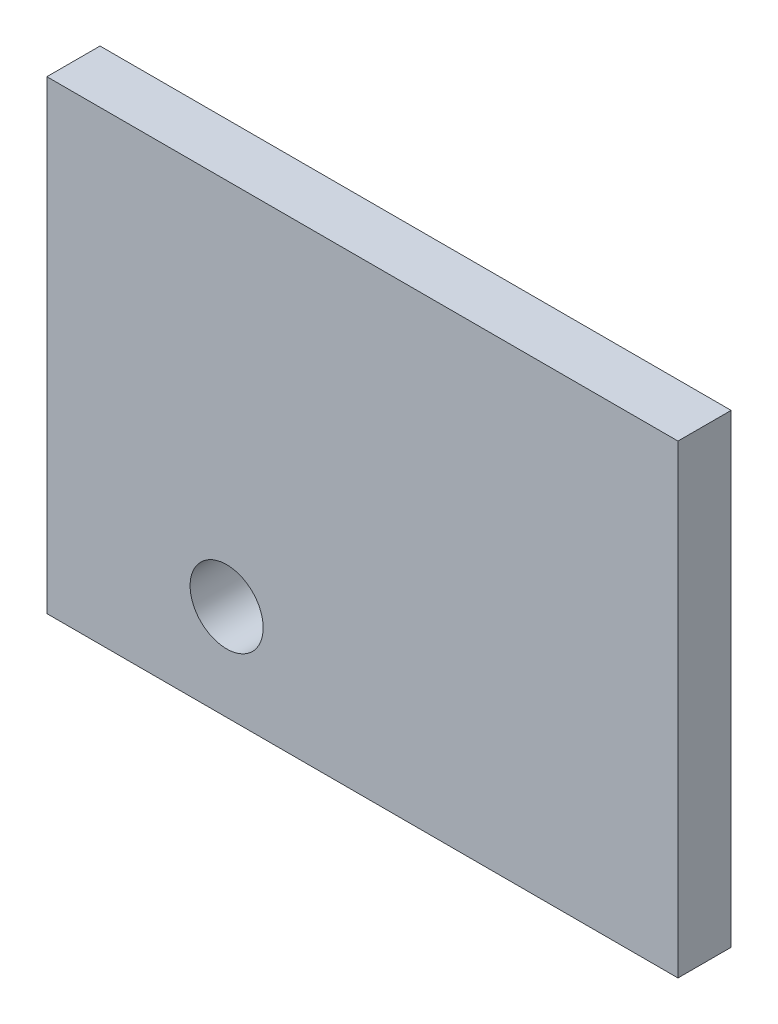
ISO-10303-21;
HEADER;
FILE_DESCRIPTION(('STEP AP214'),'2;1');
FILE_NAME('part.step','',(''),(''),'','','');
FILE_SCHEMA(('AUTOMOTIVE_DESIGN { 1 0 10303 214 1 1 1 1 }'));
ENDSEC;
DATA;
#1=APPLICATION_CONTEXT('core data for automotive mechanical design processes');
#2=APPLICATION_PROTOCOL_DEFINITION('international standard','automotive_design',2000,#1);
#3=PRODUCT_CONTEXT('',#1,'mechanical');
#4=PRODUCT('Part','Part','',(#3));
#5=PRODUCT_RELATED_PRODUCT_CATEGORY('part','',(#4));
#6=PRODUCT_DEFINITION_FORMATION('','',#4);
#7=PRODUCT_DEFINITION_CONTEXT('part definition',#1,'design');
#8=PRODUCT_DEFINITION('design','',#6,#7);
#9=PRODUCT_DEFINITION_SHAPE('','',#8);
#10=(LENGTH_UNIT() NAMED_UNIT(*) SI_UNIT(.MILLI.,.METRE.));
#11=(NAMED_UNIT(*) PLANE_ANGLE_UNIT() SI_UNIT($,.RADIAN.));
#12=(NAMED_UNIT(*) SI_UNIT($,.STERADIAN.) SOLID_ANGLE_UNIT());
#13=UNCERTAINTY_MEASURE_WITH_UNIT(LENGTH_MEASURE(1.E-05),#10,'distance_accuracy_value','');
#14=(GEOMETRIC_REPRESENTATION_CONTEXT(3) GLOBAL_UNCERTAINTY_ASSIGNED_CONTEXT((#13)) GLOBAL_UNIT_ASSIGNED_CONTEXT((#10,
#11,#12)) REPRESENTATION_CONTEXT('',''));
#15=CARTESIAN_POINT('',(0.,0.,0.));
#16=DIRECTION('',(0.,0.,1.));
#17=DIRECTION('',(1.,0.,0.));
#18=AXIS2_PLACEMENT_3D('',#15,#16,#17);
#19=CARTESIAN_POINT('',(-11.,-7.,1.6));
#20=DIRECTION('',(0.,0.,-1.));
#21=DIRECTION('',(-1.,0.,0.));
#22=AXIS2_PLACEMENT_3D('',#19,#20,#21);
#23=PLANE('',#22);
#24=CARTESIAN_POINT('',(-5.588,-4.1148,1.6));
#25=DIRECTION('',(0.,0.,1.));
#26=DIRECTION('',(1.,0.,0.));
#27=AXIS2_PLACEMENT_3D('',#24,#25,#26);
#28=CIRCLE('',#27,1.1);
#29=CARTESIAN_POINT('',(-4.488,-4.1148,1.6));
#30=VERTEX_POINT('',#29);
#31=EDGE_CURVE('E19',#30,#30,#28,.F.);
#32=ORIENTED_EDGE('',*,*,#31,.T.);
#33=EDGE_LOOP('',(#32));
#34=FACE_BOUND('',#33,.T.);
#35=DIRECTION('',(1.,0.,0.));
#36=VECTOR('',#35,1.);
#37=CARTESIAN_POINT('',(8.,7.,1.6));
#38=LINE('',#37,#36);
#39=CARTESIAN_POINT('',(8.,7.,1.6));
#40=VERTEX_POINT('',#39);
#41=CARTESIAN_POINT('',(-11.,7.,1.6));
#42=VERTEX_POINT('',#41);
#43=EDGE_CURVE('E53',#40,#42,#38,.F.);
#44=ORIENTED_EDGE('',*,*,#43,.T.);
#45=DIRECTION('',(0.,1.,0.));
#46=VECTOR('',#45,1.);
#47=CARTESIAN_POINT('',(-11.,7.,1.6));
#48=LINE('',#47,#46);
#49=CARTESIAN_POINT('',(-11.,-7.,1.6));
#50=VERTEX_POINT('',#49);
#51=EDGE_CURVE('E55',#42,#50,#48,.F.);
#52=ORIENTED_EDGE('',*,*,#51,.T.);
#53=DIRECTION('',(1.,0.,0.));
#54=VECTOR('',#53,1.);
#55=CARTESIAN_POINT('',(-11.,-7.,1.6));
#56=LINE('',#55,#54);
#57=CARTESIAN_POINT('',(8.,-7.,1.6));
#58=VERTEX_POINT('',#57);
#59=EDGE_CURVE('E57',#50,#58,#56,.T.);
#60=ORIENTED_EDGE('',*,*,#59,.T.);
#61=DIRECTION('',(0.,1.,0.));
#62=VECTOR('',#61,1.);
#63=CARTESIAN_POINT('',(8.,-7.,1.6));
#64=LINE('',#63,#62);
#65=EDGE_CURVE('E81',#58,#40,#64,.T.);
#66=ORIENTED_EDGE('',*,*,#65,.T.);
#67=EDGE_LOOP('',(#44,#52,#60,#66));
#68=FACE_BOUND('',#67,.T.);
#69=ADVANCED_FACE('F16',(#34,#68),#23,.F.);
#70=CARTESIAN_POINT('',(-11.,-7.,0.));
#71=DIRECTION('',(0.,1.,0.));
#72=DIRECTION('',(0.,0.,1.));
#73=AXIS2_PLACEMENT_3D('',#70,#71,#72);
#74=PLANE('',#73);
#75=DIRECTION('',(0.,0.,1.));
#76=VECTOR('',#75,1.);
#77=CARTESIAN_POINT('',(8.,-7.,0.));
#78=LINE('',#77,#76);
#79=CARTESIAN_POINT('',(8.,-7.,0.));
#80=VERTEX_POINT('',#79);
#81=EDGE_CURVE('E68',#80,#58,#78,.T.);
#82=ORIENTED_EDGE('',*,*,#81,.T.);
#83=ORIENTED_EDGE('',*,*,#59,.F.);
#84=DIRECTION('',(0.,0.,-1.));
#85=VECTOR('',#84,1.);
#86=CARTESIAN_POINT('',(-11.,-7.,0.));
#87=LINE('',#86,#85);
#88=CARTESIAN_POINT('',(-11.,-7.,0.));
#89=VERTEX_POINT('',#88);
#90=EDGE_CURVE('E62',#50,#89,#87,.T.);
#91=ORIENTED_EDGE('',*,*,#90,.T.);
#92=DIRECTION('',(-1.,0.,0.));
#93=VECTOR('',#92,1.);
#94=CARTESIAN_POINT('',(-11.,-7.,0.));
#95=LINE('',#94,#93);
#96=EDGE_CURVE('E84',#80,#89,#95,.T.);
#97=ORIENTED_EDGE('',*,*,#96,.F.);
#98=EDGE_LOOP('',(#82,#83,#91,#97));
#99=FACE_BOUND('',#98,.T.);
#100=ADVANCED_FACE('F65',(#99),#74,.F.);
#101=CARTESIAN_POINT('',(-11.,7.,0.));
#102=DIRECTION('',(1.,0.,0.));
#103=DIRECTION('',(0.,0.,-1.));
#104=AXIS2_PLACEMENT_3D('',#101,#102,#103);
#105=PLANE('',#104);
#106=ORIENTED_EDGE('',*,*,#90,.F.);
#107=ORIENTED_EDGE('',*,*,#51,.F.);
#108=DIRECTION('',(0.,0.,-1.));
#109=VECTOR('',#108,1.);
#110=CARTESIAN_POINT('',(-11.,7.,0.));
#111=LINE('',#110,#109);
#112=CARTESIAN_POINT('',(-11.,7.,0.));
#113=VERTEX_POINT('',#112);
#114=EDGE_CURVE('E76',#42,#113,#111,.T.);
#115=ORIENTED_EDGE('',*,*,#114,.T.);
#116=DIRECTION('',(0.,1.,0.));
#117=VECTOR('',#116,1.);
#118=CARTESIAN_POINT('',(-11.,-7.,0.));
#119=LINE('',#118,#117);
#120=EDGE_CURVE('E73',#89,#113,#119,.T.);
#121=ORIENTED_EDGE('',*,*,#120,.F.);
#122=EDGE_LOOP('',(#106,#107,#115,#121));
#123=FACE_BOUND('',#122,.T.);
#124=ADVANCED_FACE('F71',(#123),#105,.F.);
#125=CARTESIAN_POINT('',(8.,7.,0.));
#126=DIRECTION('',(0.,-1.,0.));
#127=DIRECTION('',(0.,0.,-1.));
#128=AXIS2_PLACEMENT_3D('',#125,#126,#127);
#129=PLANE('',#128);
#130=ORIENTED_EDGE('',*,*,#114,.F.);
#131=ORIENTED_EDGE('',*,*,#43,.F.);
#132=DIRECTION('',(0.,0.,1.));
#133=VECTOR('',#132,1.);
#134=CARTESIAN_POINT('',(8.,7.,0.));
#135=LINE('',#134,#133);
#136=CARTESIAN_POINT('',(8.,7.,0.));
#137=VERTEX_POINT('',#136);
#138=EDGE_CURVE('E33',#40,#137,#135,.F.);
#139=ORIENTED_EDGE('',*,*,#138,.T.);
#140=DIRECTION('',(-1.,0.,0.));
#141=VECTOR('',#140,1.);
#142=CARTESIAN_POINT('',(-11.,7.,0.));
#143=LINE('',#142,#141);
#144=EDGE_CURVE('E87',#113,#137,#143,.F.);
#145=ORIENTED_EDGE('',*,*,#144,.F.);
#146=EDGE_LOOP('',(#130,#131,#139,#145));
#147=FACE_BOUND('',#146,.T.);
#148=ADVANCED_FACE('F95',(#147),#129,.F.);
#149=CARTESIAN_POINT('',(8.,-7.,0.));
#150=DIRECTION('',(-1.,0.,0.));
#151=DIRECTION('',(0.,0.,1.));
#152=AXIS2_PLACEMENT_3D('',#149,#150,#151);
#153=PLANE('',#152);
#154=ORIENTED_EDGE('',*,*,#138,.F.);
#155=ORIENTED_EDGE('',*,*,#65,.F.);
#156=ORIENTED_EDGE('',*,*,#81,.F.);
#157=DIRECTION('',(0.,1.,0.));
#158=VECTOR('',#157,1.);
#159=CARTESIAN_POINT('',(8.,-7.,0.));
#160=LINE('',#159,#158);
#161=EDGE_CURVE('E25',#137,#80,#160,.F.);
#162=ORIENTED_EDGE('',*,*,#161,.F.);
#163=EDGE_LOOP('',(#154,#155,#156,#162));
#164=FACE_BOUND('',#163,.T.);
#165=ADVANCED_FACE('F94',(#164),#153,.F.);
#166=CARTESIAN_POINT('',(-5.588,-4.1148,-0.8));
#167=DIRECTION('',(0.,0.,1.));
#168=DIRECTION('',(1.,0.,0.));
#169=AXIS2_PLACEMENT_3D('',#166,#167,#168);
#170=CYLINDRICAL_SURFACE('',#169,1.1);
#171=CARTESIAN_POINT('',(-5.588,-4.1148,0.));
#172=DIRECTION('',(0.,0.,1.));
#173=DIRECTION('',(1.,0.,0.));
#174=AXIS2_PLACEMENT_3D('',#171,#172,#173);
#175=CIRCLE('',#174,1.1);
#176=CARTESIAN_POINT('',(-4.488,-4.1148,0.));
#177=VERTEX_POINT('',#176);
#178=EDGE_CURVE('E11',#177,#177,#175,.T.);
#179=ORIENTED_EDGE('',*,*,#178,.F.);
#180=EDGE_LOOP('',(#179));
#181=FACE_BOUND('',#180,.T.);
#182=ORIENTED_EDGE('',*,*,#31,.F.);
#183=EDGE_LOOP('',(#182));
#184=FACE_BOUND('',#183,.T.);
#185=ADVANCED_FACE('F103',(#181,#184),#170,.F.);
#186=CARTESIAN_POINT('',(-11.,-7.,0.));
#187=DIRECTION('',(0.,0.,-1.));
#188=DIRECTION('',(-1.,0.,0.));
#189=AXIS2_PLACEMENT_3D('',#186,#187,#188);
#190=PLANE('',#189);
#191=ORIENTED_EDGE('',*,*,#178,.T.);
#192=EDGE_LOOP('',(#191));
#193=FACE_BOUND('',#192,.T.);
#194=ORIENTED_EDGE('',*,*,#144,.T.);
#195=ORIENTED_EDGE('',*,*,#161,.T.);
#196=ORIENTED_EDGE('',*,*,#96,.T.);
#197=ORIENTED_EDGE('',*,*,#120,.T.);
#198=EDGE_LOOP('',(#194,#195,#196,#197));
#199=FACE_BOUND('',#198,.T.);
#200=ADVANCED_FACE('F92',(#193,#199),#190,.T.);
#201=CLOSED_SHELL('',(#69,#100,#124,#148,#165,#185,#200));
#202=MANIFOLD_SOLID_BREP('B1',#201);
#203=ADVANCED_BREP_SHAPE_REPRESENTATION('',(#18,#202),#14);
#204=SHAPE_DEFINITION_REPRESENTATION(#9,#203);
ENDSEC;
END-ISO-10303-21;
